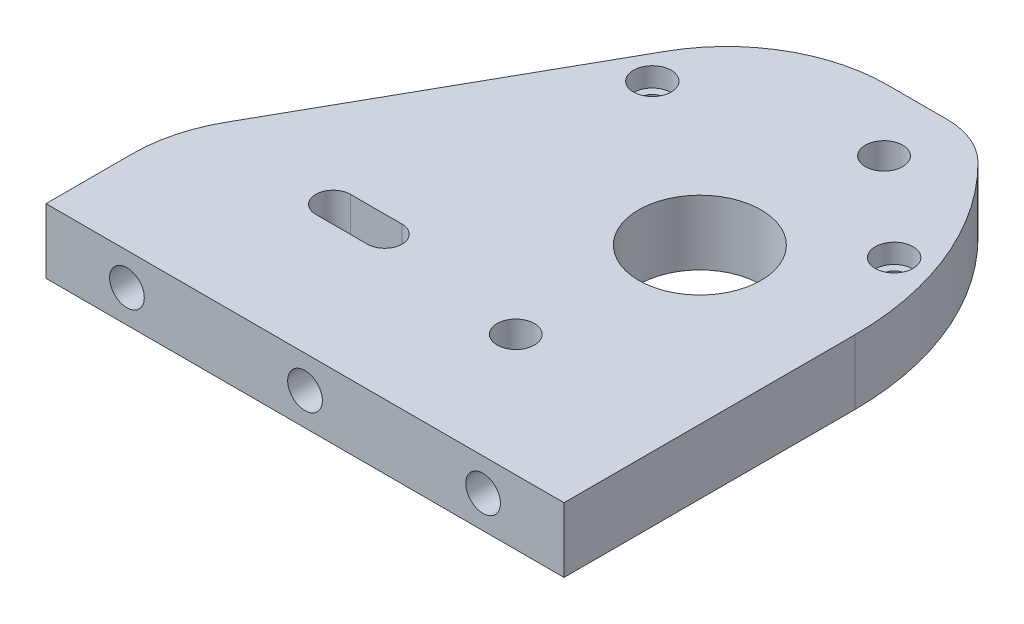
ISO-10303-21;
HEADER;
FILE_DESCRIPTION(('STEP AP214'),'2;1');
FILE_NAME('part.step','',(''),(''),'','','');
FILE_SCHEMA(('AUTOMOTIVE_DESIGN { 1 0 10303 214 1 1 1 1 }'));
ENDSEC;
DATA;
#1=APPLICATION_CONTEXT('core data for automotive mechanical design processes');
#2=APPLICATION_PROTOCOL_DEFINITION('international standard','automotive_design',2000,#1);
#3=PRODUCT_CONTEXT('',#1,'mechanical');
#4=PRODUCT('Part','Part','',(#3));
#5=PRODUCT_RELATED_PRODUCT_CATEGORY('part','',(#4));
#6=PRODUCT_DEFINITION_FORMATION('','',#4);
#7=PRODUCT_DEFINITION_CONTEXT('part definition',#1,'design');
#8=PRODUCT_DEFINITION('design','',#6,#7);
#9=PRODUCT_DEFINITION_SHAPE('','',#8);
#10=(LENGTH_UNIT() NAMED_UNIT(*) SI_UNIT(.MILLI.,.METRE.));
#11=(NAMED_UNIT(*) PLANE_ANGLE_UNIT() SI_UNIT($,.RADIAN.));
#12=(NAMED_UNIT(*) SI_UNIT($,.STERADIAN.) SOLID_ANGLE_UNIT());
#13=UNCERTAINTY_MEASURE_WITH_UNIT(LENGTH_MEASURE(1.E-05),#10,'distance_accuracy_value','');
#14=(GEOMETRIC_REPRESENTATION_CONTEXT(3) GLOBAL_UNCERTAINTY_ASSIGNED_CONTEXT((#13)) GLOBAL_UNIT_ASSIGNED_CONTEXT((#10,
#11,#12)) REPRESENTATION_CONTEXT('',''));
#15=CARTESIAN_POINT('',(0.,0.,0.));
#16=DIRECTION('',(0.,0.,1.));
#17=DIRECTION('',(1.,0.,0.));
#18=AXIS2_PLACEMENT_3D('',#15,#16,#17);
#19=CARTESIAN_POINT('',(0.,-9.525,0.));
#20=DIRECTION('',(0.,1.,0.));
#21=DIRECTION('',(0.,0.,-1.));
#22=AXIS2_PLACEMENT_3D('',#19,#20,#21);
#23=PLANE('',#22);
#24=DIRECTION('',(1.,0.,0.));
#25=VECTOR('',#24,1.);
#26=CARTESIAN_POINT('',(18.030825,-9.525,-23.5800563674416));
#27=LINE('',#26,#25);
#28=CARTESIAN_POINT('',(18.030825,-9.525,-23.5800563674416));
#29=VERTEX_POINT('',#28);
#30=CARTESIAN_POINT('',(25.625425,-9.525,-23.5800563674416));
#31=VERTEX_POINT('',#30);
#32=EDGE_CURVE('E222',#29,#31,#27,.T.);
#33=ORIENTED_EDGE('',*,*,#32,.F.);
#34=CARTESIAN_POINT('',(18.030825,-9.525,-21.0273563674416));
#35=DIRECTION('',(0.,1.,0.));
#36=DIRECTION('',(0.,0.,1.));
#37=AXIS2_PLACEMENT_3D('',#34,#35,#36);
#38=CIRCLE('',#37,2.5527);
#39=CARTESIAN_POINT('',(18.030825,-9.525,-18.4746563674416));
#40=VERTEX_POINT('',#39);
#41=EDGE_CURVE('E224',#29,#40,#38,.T.);
#42=ORIENTED_EDGE('',*,*,#41,.T.);
#43=DIRECTION('',(1.,0.,0.));
#44=VECTOR('',#43,1.);
#45=CARTESIAN_POINT('',(18.030825,-9.525,-18.4746563674416));
#46=LINE('',#45,#44);
#47=CARTESIAN_POINT('',(25.625425,-9.525,-18.4746563674416));
#48=VERTEX_POINT('',#47);
#49=EDGE_CURVE('E215',#40,#48,#46,.T.);
#50=ORIENTED_EDGE('',*,*,#49,.T.);
#51=CARTESIAN_POINT('',(25.625425,-9.525,-21.0273563674416));
#52=DIRECTION('',(0.,1.,0.));
#53=DIRECTION('',(0.,0.,1.));
#54=AXIS2_PLACEMENT_3D('',#51,#52,#53);
#55=CIRCLE('',#54,2.5527);
#56=EDGE_CURVE('E230',#48,#31,#55,.T.);
#57=ORIENTED_EDGE('',*,*,#56,.T.);
#58=EDGE_LOOP('',(#33,#42,#50,#57));
#59=FACE_BOUND('',#58,.T.);
#60=CARTESIAN_POINT('',(25.8140218113133,-9.525,-60.2002575391825));
#61=DIRECTION('',(0.,-1.,0.));
#62=DIRECTION('',(0.,0.,-1.));
#63=AXIS2_PLACEMENT_3D('',#60,#61,#62);
#64=CIRCLE('',#63,1.63195);
#65=CARTESIAN_POINT('',(25.8140218113133,-9.525,-61.8322075391825));
#66=VERTEX_POINT('',#65);
#67=EDGE_CURVE('E246',#66,#66,#64,.T.);
#68=ORIENTED_EDGE('',*,*,#67,.F.);
#69=EDGE_LOOP('',(#68));
#70=FACE_BOUND('',#69,.T.);
#71=CARTESIAN_POINT('',(66.0757685720033,-9.525,-55.5088169021917));
#72=DIRECTION('',(0.,-1.,0.));
#73=DIRECTION('',(0.,0.,-1.));
#74=AXIS2_PLACEMENT_3D('',#71,#72,#73);
#75=CIRCLE('',#74,1.63194999999999);
#76=CARTESIAN_POINT('',(66.0757685720033,-9.525,-57.1407669021917));
#77=VERTEX_POINT('',#76);
#78=EDGE_CURVE('E258',#77,#77,#75,.T.);
#79=ORIENTED_EDGE('',*,*,#78,.F.);
#80=EDGE_LOOP('',(#79));
#81=FACE_BOUND('',#80,.T.);
#82=CARTESIAN_POINT('',(52.3796621440065,-9.525,-67.7136843923407));
#83=DIRECTION('',(0.,1.,0.));
#84=DIRECTION('',(0.,0.,1.));
#85=AXIS2_PLACEMENT_3D('',#82,#83,#84);
#86=CIRCLE('',#85,6.11999999999999);
#87=CARTESIAN_POINT('',(52.3796621440065,-9.525,-61.5936843923407));
#88=VERTEX_POINT('',#87);
#89=EDGE_CURVE('E261',#88,#88,#86,.T.);
#90=ORIENTED_EDGE('',*,*,#89,.T.);
#91=EDGE_LOOP('',(#90));
#92=FACE_BOUND('',#91,.T.);
#93=CARTESIAN_POINT('',(48.021875,-9.525,-17.9039494120426));
#94=DIRECTION('',(0.,1.,0.));
#95=DIRECTION('',(0.,0.,1.));
#96=AXIS2_PLACEMENT_3D('',#93,#94,#95);
#97=CIRCLE('',#96,6.11999999999999);
#98=CARTESIAN_POINT('',(48.021875,-9.525,-11.7839494120426));
#99=VERTEX_POINT('',#98);
#100=EDGE_CURVE('E273',#99,#99,#97,.T.);
#101=ORIENTED_EDGE('',*,*,#100,.T.);
#102=EDGE_LOOP('',(#101));
#103=FACE_BOUND('',#102,.T.);
#104=CARTESIAN_POINT('',(50.2007685720033,-9.525,-42.8088169021917));
#105=DIRECTION('',(0.,1.,0.));
#106=DIRECTION('',(0.,0.,1.));
#107=AXIS2_PLACEMENT_3D('',#104,#105,#106);
#108=CIRCLE('',#107,8.99999999999999);
#109=CARTESIAN_POINT('',(50.2007685720033,-9.525,-33.8088169021917));
#110=VERTEX_POINT('',#109);
#111=EDGE_CURVE('E285',#110,#110,#108,.T.);
#112=ORIENTED_EDGE('',*,*,#111,.T.);
#113=EDGE_LOOP('',(#112));
#114=FACE_BOUND('',#113,.T.);
#115=DIRECTION('',(0.,0.,1.));
#116=VECTOR('',#115,1.);
#117=CARTESIAN_POINT('',(73.025,-9.52500000000001,-101.6));
#118=LINE('',#117,#116);
#119=CARTESIAN_POINT('',(73.025,-9.52500000000001,-42.7680148106246));
#120=VERTEX_POINT('',#119);
#121=CARTESIAN_POINT('',(73.025,-9.52500000000001,0.));
#122=VERTEX_POINT('',#121);
#123=EDGE_CURVE('E213',#120,#122,#118,.T.);
#124=ORIENTED_EDGE('',*,*,#123,.T.);
#125=DIRECTION('',(1.,0.,0.));
#126=VECTOR('',#125,1.);
#127=CARTESIAN_POINT('',(0.,-9.525,0.));
#128=LINE('',#127,#126);
#129=CARTESIAN_POINT('',(-3.17499999999998,-9.52500000000001,0.));
#130=VERTEX_POINT('',#129);
#131=EDGE_CURVE('E310',#130,#122,#128,.T.);
#132=ORIENTED_EDGE('',*,*,#131,.F.);
#133=DIRECTION('',(0.,0.,-1.));
#134=VECTOR('',#133,1.);
#135=CARTESIAN_POINT('',(-3.175,-9.52500000000001,-101.6));
#136=LINE('',#135,#134);
#137=CARTESIAN_POINT('',(-3.17499999999998,-9.52500000000001,-12.7));
#138=VERTEX_POINT('',#137);
#139=EDGE_CURVE('E205',#130,#138,#136,.T.);
#140=ORIENTED_EDGE('',*,*,#139,.T.);
#141=CARTESIAN_POINT('',(19.0002047376904,-9.52500000000001,-12.7));
#142=DIRECTION('',(0.,1.,0.));
#143=DIRECTION('',(0.,0.,1.));
#144=AXIS2_PLACEMENT_3D('',#141,#142,#143);
#145=CIRCLE('',#144,22.1752047376904);
#146=CARTESIAN_POINT('',(-0.322426516871673,-9.52500000000001,-23.5800563674416));
#147=VERTEX_POINT('',#146);
#148=EDGE_CURVE('E178',#147,#138,#145,.T.);
#149=ORIENTED_EDGE('',*,*,#148,.F.);
#150=DIRECTION('',(-0.490640627500011,0.,0.871362022724422));
#151=VECTOR('',#150,1.);
#152=CARTESIAN_POINT('',(-10.3258873267677,-9.52500000000001,-5.8142307162519));
#153=LINE('',#152,#151);
#154=CARTESIAN_POINT('',(22.9795865303334,-9.52500000000001,-64.9636843923407));
#155=VERTEX_POINT('',#154);
#156=EDGE_CURVE('E180',#155,#147,#153,.T.);
#157=ORIENTED_EDGE('',*,*,#156,.F.);
#158=CARTESIAN_POINT('',(43.5849903578951,-9.52500000000001,-53.3613331305353));
#159=DIRECTION('',(0.,1.,0.));
#160=DIRECTION('',(0.,0.,1.));
#161=AXIS2_PLACEMENT_3D('',#158,#159,#160);
#162=CIRCLE('',#161,23.6473512618054);
#163=CARTESIAN_POINT('',(43.5849903578951,-9.52500000000001,-77.0086843923407));
#164=VERTEX_POINT('',#163);
#165=EDGE_CURVE('E170',#164,#155,#162,.T.);
#166=ORIENTED_EDGE('',*,*,#165,.F.);
#167=DIRECTION('',(-1.,0.,0.));
#168=VECTOR('',#167,1.);
#169=CARTESIAN_POINT('',(1.21517915318178E-13,-9.52500000000001,-77.0086843923408));
#170=LINE('',#169,#168);
#171=CARTESIAN_POINT('',(52.3796621440065,-9.52500000000001,-77.0086843923407));
#172=VERTEX_POINT('',#171);
#173=EDGE_CURVE('E149',#172,#164,#170,.T.);
#174=ORIENTED_EDGE('',*,*,#173,.F.);
#175=CARTESIAN_POINT('',(52.3796621440065,-9.52500000000001,-66.0667424082866));
#176=DIRECTION('',(0.,1.,0.));
#177=DIRECTION('',(0.,0.,1.));
#178=AXIS2_PLACEMENT_3D('',#175,#176,#177);
#179=CIRCLE('',#178,10.9419419840542);
#180=CARTESIAN_POINT('',(60.0868475316006,-9.52500000000001,-73.8336843923407));
#181=VERTEX_POINT('',#180);
#182=EDGE_CURVE('E160',#172,#181,#179,.F.);
#183=ORIENTED_EDGE('',*,*,#182,.T.);
#184=CARTESIAN_POINT('',(29.2601881915944,-9.52500000000001,-42.7680148106246));
#185=DIRECTION('',(0.,1.,0.));
#186=DIRECTION('',(0.,0.,1.));
#187=AXIS2_PLACEMENT_3D('',#184,#185,#186);
#188=CIRCLE('',#187,43.7648118084056);
#189=EDGE_CURVE('E165',#120,#181,#188,.T.);
#190=ORIENTED_EDGE('',*,*,#189,.F.);
#191=EDGE_LOOP('',(#124,#132,#140,#149,#157,#166,#174,#183,#190));
#192=FACE_BOUND('',#191,.T.);
#193=ADVANCED_FACE('F39',(#59,#70,#81,#92,#103,#114,#192),#23,.F.);
#194=CARTESIAN_POINT('',(0.,0.,0.));
#195=DIRECTION('',(0.,1.,0.));
#196=DIRECTION('',(0.,0.,-1.));
#197=AXIS2_PLACEMENT_3D('',#194,#195,#196);
#198=PLANE('',#197);
#199=CARTESIAN_POINT('',(50.2007685720033,0.,-42.8088169021917));
#200=DIRECTION('',(0.,1.,0.));
#201=DIRECTION('',(0.,0.,1.));
#202=AXIS2_PLACEMENT_3D('',#199,#200,#201);
#203=CIRCLE('',#202,9.);
#204=CARTESIAN_POINT('',(50.2007685720033,0.,-33.8088169021917));
#205=VERTEX_POINT('',#204);
#206=EDGE_CURVE('E288',#205,#205,#203,.T.);
#207=ORIENTED_EDGE('',*,*,#206,.F.);
#208=EDGE_LOOP('',(#207));
#209=FACE_BOUND('',#208,.T.);
#210=CARTESIAN_POINT('',(48.021875,0.,-17.9039494120426));
#211=DIRECTION('',(0.,1.,0.));
#212=DIRECTION('',(0.,0.,1.));
#213=AXIS2_PLACEMENT_3D('',#210,#211,#212);
#214=CIRCLE('',#213,2.75);
#215=CARTESIAN_POINT('',(48.021875,0.,-15.1539494120426));
#216=VERTEX_POINT('',#215);
#217=EDGE_CURVE('E282',#216,#216,#214,.T.);
#218=ORIENTED_EDGE('',*,*,#217,.F.);
#219=EDGE_LOOP('',(#218));
#220=FACE_BOUND('',#219,.T.);
#221=CARTESIAN_POINT('',(52.3796621440065,0.,-67.7136843923407));
#222=DIRECTION('',(0.,1.,0.));
#223=DIRECTION('',(0.,0.,1.));
#224=AXIS2_PLACEMENT_3D('',#221,#222,#223);
#225=CIRCLE('',#224,2.75);
#226=CARTESIAN_POINT('',(52.3796621440065,0.,-64.9636843923407));
#227=VERTEX_POINT('',#226);
#228=EDGE_CURVE('E270',#227,#227,#225,.T.);
#229=ORIENTED_EDGE('',*,*,#228,.F.);
#230=EDGE_LOOP('',(#229));
#231=FACE_BOUND('',#230,.T.);
#232=CARTESIAN_POINT('',(66.0757685720033,0.,-55.5088169021917));
#233=DIRECTION('',(0.,-1.,0.));
#234=DIRECTION('',(0.,0.,-1.));
#235=AXIS2_PLACEMENT_3D('',#232,#233,#234);
#236=CIRCLE('',#235,2.77876000000001);
#237=CARTESIAN_POINT('',(66.0757685720033,0.,-58.2875769021917));
#238=VERTEX_POINT('',#237);
#239=EDGE_CURVE('E249',#238,#238,#236,.T.);
#240=ORIENTED_EDGE('',*,*,#239,.T.);
#241=EDGE_LOOP('',(#240));
#242=FACE_BOUND('',#241,.T.);
#243=CARTESIAN_POINT('',(25.8140218113133,0.,-60.2002575391825));
#244=DIRECTION('',(0.,-1.,0.));
#245=DIRECTION('',(0.,0.,-1.));
#246=AXIS2_PLACEMENT_3D('',#243,#244,#245);
#247=CIRCLE('',#246,2.77876);
#248=CARTESIAN_POINT('',(25.8140218113133,0.,-62.9790175391825));
#249=VERTEX_POINT('',#248);
#250=EDGE_CURVE('E237',#249,#249,#247,.T.);
#251=ORIENTED_EDGE('',*,*,#250,.T.);
#252=EDGE_LOOP('',(#251));
#253=FACE_BOUND('',#252,.T.);
#254=DIRECTION('',(-1.,0.,0.));
#255=VECTOR('',#254,1.);
#256=CARTESIAN_POINT('',(0.,0.,-18.4746563674416));
#257=LINE('',#256,#255);
#258=CARTESIAN_POINT('',(25.625425,0.,-18.4746563674416));
#259=VERTEX_POINT('',#258);
#260=CARTESIAN_POINT('',(18.030825,0.,-18.4746563674416));
#261=VERTEX_POINT('',#260);
#262=EDGE_CURVE('E11',#259,#261,#257,.T.);
#263=ORIENTED_EDGE('',*,*,#262,.T.);
#264=CARTESIAN_POINT('',(18.030825,0.,-21.0273563674416));
#265=DIRECTION('',(0.,-1.,0.));
#266=DIRECTION('',(0.,0.,-1.));
#267=AXIS2_PLACEMENT_3D('',#264,#265,#266);
#268=CIRCLE('',#267,2.5527);
#269=CARTESIAN_POINT('',(18.030825,0.,-23.5800563674416));
#270=VERTEX_POINT('',#269);
#271=EDGE_CURVE('E47',#261,#270,#268,.T.);
#272=ORIENTED_EDGE('',*,*,#271,.T.);
#273=DIRECTION('',(1.,0.,0.));
#274=VECTOR('',#273,1.);
#275=CARTESIAN_POINT('',(0.,0.,-23.5800563674416));
#276=LINE('',#275,#274);
#277=CARTESIAN_POINT('',(25.625425,0.,-23.5800563674416));
#278=VERTEX_POINT('',#277);
#279=EDGE_CURVE('E313',#270,#278,#276,.T.);
#280=ORIENTED_EDGE('',*,*,#279,.T.);
#281=CARTESIAN_POINT('',(25.625425,0.,-21.0273563674416));
#282=DIRECTION('',(0.,-1.,0.));
#283=DIRECTION('',(0.,0.,-1.));
#284=AXIS2_PLACEMENT_3D('',#281,#282,#283);
#285=CIRCLE('',#284,2.5527);
#286=EDGE_CURVE('E318',#278,#259,#285,.T.);
#287=ORIENTED_EDGE('',*,*,#286,.T.);
#288=EDGE_LOOP('',(#263,#272,#280,#287));
#289=FACE_BOUND('',#288,.T.);
#290=CARTESIAN_POINT('',(29.2601881915944,0.,-42.7680148106246));
#291=DIRECTION('',(0.,1.,0.));
#292=DIRECTION('',(0.,0.,1.));
#293=AXIS2_PLACEMENT_3D('',#290,#291,#292);
#294=CIRCLE('',#293,43.7648118084056);
#295=CARTESIAN_POINT('',(73.025,0.,-42.7680148106246));
#296=VERTEX_POINT('',#295);
#297=CARTESIAN_POINT('',(60.0868475316006,0.,-73.8336843923407));
#298=VERTEX_POINT('',#297);
#299=EDGE_CURVE('E188',#296,#298,#294,.T.);
#300=ORIENTED_EDGE('',*,*,#299,.T.);
#301=CARTESIAN_POINT('',(52.3796621440065,0.,-66.0667424082866));
#302=DIRECTION('',(0.,1.,0.));
#303=DIRECTION('',(0.,0.,1.));
#304=AXIS2_PLACEMENT_3D('',#301,#302,#303);
#305=CIRCLE('',#304,10.9419419840542);
#306=CARTESIAN_POINT('',(52.3796621440065,0.,-77.0086843923407));
#307=VERTEX_POINT('',#306);
#308=EDGE_CURVE('E186',#307,#298,#305,.F.);
#309=ORIENTED_EDGE('',*,*,#308,.F.);
#310=DIRECTION('',(-1.,0.,0.));
#311=VECTOR('',#310,1.);
#312=CARTESIAN_POINT('',(1.21517915318178E-13,0.,-77.0086843923408));
#313=LINE('',#312,#311);
#314=CARTESIAN_POINT('',(43.5849903578951,0.,-77.0086843923407));
#315=VERTEX_POINT('',#314);
#316=EDGE_CURVE('E152',#307,#315,#313,.T.);
#317=ORIENTED_EDGE('',*,*,#316,.T.);
#318=CARTESIAN_POINT('',(43.5849903578951,0.,-53.3613331305353));
#319=DIRECTION('',(0.,1.,0.));
#320=DIRECTION('',(0.,0.,1.));
#321=AXIS2_PLACEMENT_3D('',#318,#319,#320);
#322=CIRCLE('',#321,23.6473512618054);
#323=CARTESIAN_POINT('',(22.9795865303334,0.,-64.9636843923407));
#324=VERTEX_POINT('',#323);
#325=EDGE_CURVE('E171',#315,#324,#322,.T.);
#326=ORIENTED_EDGE('',*,*,#325,.T.);
#327=DIRECTION('',(-0.490640627500011,0.,0.871362022724422));
#328=VECTOR('',#327,1.);
#329=CARTESIAN_POINT('',(-10.3258873267677,0.,-5.8142307162519));
#330=LINE('',#329,#328);
#331=CARTESIAN_POINT('',(-0.322426516871673,0.,-23.5800563674416));
#332=VERTEX_POINT('',#331);
#333=EDGE_CURVE('E174',#324,#332,#330,.T.);
#334=ORIENTED_EDGE('',*,*,#333,.T.);
#335=CARTESIAN_POINT('',(19.0002047376904,0.,-12.7));
#336=DIRECTION('',(0.,1.,0.));
#337=DIRECTION('',(0.,0.,1.));
#338=AXIS2_PLACEMENT_3D('',#335,#336,#337);
#339=CIRCLE('',#338,22.1752047376904);
#340=CARTESIAN_POINT('',(-3.17499999999999,0.,-12.7));
#341=VERTEX_POINT('',#340);
#342=EDGE_CURVE('E191',#332,#341,#339,.T.);
#343=ORIENTED_EDGE('',*,*,#342,.T.);
#344=DIRECTION('',(0.,0.,1.));
#345=VECTOR('',#344,1.);
#346=CARTESIAN_POINT('',(-3.175,0.,-101.6));
#347=LINE('',#346,#345);
#348=CARTESIAN_POINT('',(-3.17499999999998,0.,0.));
#349=VERTEX_POINT('',#348);
#350=EDGE_CURVE('E156',#341,#349,#347,.T.);
#351=ORIENTED_EDGE('',*,*,#350,.T.);
#352=DIRECTION('',(1.,0.,0.));
#353=VECTOR('',#352,1.);
#354=CARTESIAN_POINT('',(0.,0.,0.));
#355=LINE('',#354,#353);
#356=CARTESIAN_POINT('',(73.025,0.,0.));
#357=VERTEX_POINT('',#356);
#358=EDGE_CURVE('E309',#349,#357,#355,.T.);
#359=ORIENTED_EDGE('',*,*,#358,.T.);
#360=DIRECTION('',(0.,0.,-1.));
#361=VECTOR('',#360,1.);
#362=CARTESIAN_POINT('',(73.025,0.,-101.6));
#363=LINE('',#362,#361);
#364=EDGE_CURVE('E208',#357,#296,#363,.T.);
#365=ORIENTED_EDGE('',*,*,#364,.T.);
#366=EDGE_LOOP('',(#300,#309,#317,#326,#334,#343,#351,#359,#365));
#367=FACE_BOUND('',#366,.T.);
#368=ADVANCED_FACE('F323',(#209,#220,#231,#242,#253,#289,#367),#198,.T.);
#369=CARTESIAN_POINT('',(-3.175,-111.174597269246,-101.6));
#370=DIRECTION('',(1.,0.,0.));
#371=DIRECTION('',(0.,0.,-1.));
#372=AXIS2_PLACEMENT_3D('',#369,#370,#371);
#373=PLANE('',#372);
#374=DIRECTION('',(0.,1.,0.));
#375=VECTOR('',#374,1.);
#376=CARTESIAN_POINT('',(-3.17499999999998,-9.52500000000001,-12.7));
#377=LINE('',#376,#375);
#378=EDGE_CURVE('E54',#138,#341,#377,.T.);
#379=ORIENTED_EDGE('',*,*,#378,.F.);
#380=ORIENTED_EDGE('',*,*,#139,.F.);
#381=DIRECTION('',(0.,1.,0.));
#382=VECTOR('',#381,1.);
#383=CARTESIAN_POINT('',(-3.17499999999998,-111.174597269246,0.));
#384=LINE('',#383,#382);
#385=EDGE_CURVE('E209',#130,#349,#384,.T.);
#386=ORIENTED_EDGE('',*,*,#385,.T.);
#387=ORIENTED_EDGE('',*,*,#350,.F.);
#388=EDGE_LOOP('',(#379,#380,#386,#387));
#389=FACE_BOUND('',#388,.T.);
#390=ADVANCED_FACE('F388',(#389),#373,.F.);
#391=CARTESIAN_POINT('',(0.,-9.525,0.));
#392=DIRECTION('',(0.,0.,-1.));
#393=DIRECTION('',(-1.,0.,0.));
#394=AXIS2_PLACEMENT_3D('',#391,#392,#393);
#395=PLANE('',#394);
#396=CARTESIAN_POINT('',(8.73125,-4.7625,0.));
#397=DIRECTION('',(0.,0.,-1.));
#398=DIRECTION('',(1.,0.,0.));
#399=AXIS2_PLACEMENT_3D('',#396,#397,#398);
#400=CIRCLE('',#399,2.5527);
#401=CARTESIAN_POINT('',(11.28395,-4.7625,0.));
#402=VERTEX_POINT('',#401);
#403=EDGE_CURVE('E291',#402,#402,#400,.T.);
#404=ORIENTED_EDGE('',*,*,#403,.T.);
#405=EDGE_LOOP('',(#404));
#406=FACE_BOUND('',#405,.T.);
#407=CARTESIAN_POINT('',(61.11875,-4.7625,0.));
#408=DIRECTION('',(0.,0.,-1.));
#409=DIRECTION('',(1.,0.,0.));
#410=AXIS2_PLACEMENT_3D('',#407,#408,#409);
#411=CIRCLE('',#410,2.55269999999999);
#412=CARTESIAN_POINT('',(63.67145,-4.7625,0.));
#413=VERTEX_POINT('',#412);
#414=EDGE_CURVE('E297',#413,#413,#411,.T.);
#415=ORIENTED_EDGE('',*,*,#414,.T.);
#416=EDGE_LOOP('',(#415));
#417=FACE_BOUND('',#416,.T.);
#418=CARTESIAN_POINT('',(34.925,-4.7625,0.));
#419=DIRECTION('',(0.,0.,-1.));
#420=DIRECTION('',(1.,0.,0.));
#421=AXIS2_PLACEMENT_3D('',#418,#419,#420);
#422=CIRCLE('',#421,2.5527);
#423=CARTESIAN_POINT('',(37.4777,-4.7625,0.));
#424=VERTEX_POINT('',#423);
#425=EDGE_CURVE('E303',#424,#424,#422,.T.);
#426=ORIENTED_EDGE('',*,*,#425,.T.);
#427=EDGE_LOOP('',(#426));
#428=FACE_BOUND('',#427,.T.);
#429=ORIENTED_EDGE('',*,*,#358,.F.);
#430=ORIENTED_EDGE('',*,*,#385,.F.);
#431=ORIENTED_EDGE('',*,*,#131,.T.);
#432=DIRECTION('',(0.,1.,0.));
#433=VECTOR('',#432,1.);
#434=CARTESIAN_POINT('',(73.025,-111.174597269246,0.));
#435=LINE('',#434,#433);
#436=EDGE_CURVE('E216',#122,#357,#435,.T.);
#437=ORIENTED_EDGE('',*,*,#436,.T.);
#438=EDGE_LOOP('',(#429,#430,#431,#437));
#439=FACE_BOUND('',#438,.T.);
#440=ADVANCED_FACE('F41',(#406,#417,#428,#439),#395,.F.);
#441=CARTESIAN_POINT('',(34.925,-4.7625,-19.05));
#442=DIRECTION('',(0.,0.,1.));
#443=DIRECTION('',(1.,0.,0.));
#444=AXIS2_PLACEMENT_3D('',#441,#442,#443);
#445=CONICAL_SURFACE('',#444,2.5527,1.02974425867665);
#446=CARTESIAN_POINT('',(34.925,-4.7625,-20.5838169021917));
#447=VERTEX_POINT('',#446);
#448=VERTEX_LOOP('',#447);
#449=FACE_BOUND('',#448,.T.);
#450=CARTESIAN_POINT('',(34.925,-4.7625,-19.05));
#451=DIRECTION('',(0.,0.,-1.));
#452=DIRECTION('',(1.,0.,0.));
#453=AXIS2_PLACEMENT_3D('',#450,#451,#452);
#454=CIRCLE('',#453,2.5527);
#455=CARTESIAN_POINT('',(37.4777,-4.7625,-19.05));
#456=VERTEX_POINT('',#455);
#457=EDGE_CURVE('E306',#456,#456,#454,.T.);
#458=ORIENTED_EDGE('',*,*,#457,.F.);
#459=EDGE_LOOP('',(#458));
#460=FACE_BOUND('',#459,.T.);
#461=ADVANCED_FACE('F383',(#449,#460),#445,.F.);
#462=CARTESIAN_POINT('',(34.925,-4.7625,0.));
#463=DIRECTION('',(0.,0.,1.));
#464=DIRECTION('',(1.,0.,0.));
#465=AXIS2_PLACEMENT_3D('',#462,#463,#464);
#466=CYLINDRICAL_SURFACE('',#465,2.5527);
#467=ORIENTED_EDGE('',*,*,#457,.T.);
#468=EDGE_LOOP('',(#467));
#469=FACE_BOUND('',#468,.T.);
#470=ORIENTED_EDGE('',*,*,#425,.F.);
#471=EDGE_LOOP('',(#470));
#472=FACE_BOUND('',#471,.T.);
#473=ADVANCED_FACE('F379',(#469,#472),#466,.F.);
#474=CARTESIAN_POINT('',(61.11875,-4.7625,-19.05));
#475=DIRECTION('',(0.,0.,1.));
#476=DIRECTION('',(1.,0.,0.));
#477=AXIS2_PLACEMENT_3D('',#474,#475,#476);
#478=CONICAL_SURFACE('',#477,2.55269999999999,1.02974425867665);
#479=CARTESIAN_POINT('',(61.11875,-4.7625,-20.5838169021917));
#480=VERTEX_POINT('',#479);
#481=VERTEX_LOOP('',#480);
#482=FACE_BOUND('',#481,.T.);
#483=CARTESIAN_POINT('',(61.11875,-4.7625,-19.05));
#484=DIRECTION('',(0.,0.,-1.));
#485=DIRECTION('',(1.,0.,0.));
#486=AXIS2_PLACEMENT_3D('',#483,#484,#485);
#487=CIRCLE('',#486,2.55269999999999);
#488=CARTESIAN_POINT('',(63.67145,-4.7625,-19.05));
#489=VERTEX_POINT('',#488);
#490=EDGE_CURVE('E300',#489,#489,#487,.T.);
#491=ORIENTED_EDGE('',*,*,#490,.F.);
#492=EDGE_LOOP('',(#491));
#493=FACE_BOUND('',#492,.T.);
#494=ADVANCED_FACE('F375',(#482,#493),#478,.F.);
#495=CARTESIAN_POINT('',(61.11875,-4.7625,0.));
#496=DIRECTION('',(0.,0.,1.));
#497=DIRECTION('',(1.,0.,0.));
#498=AXIS2_PLACEMENT_3D('',#495,#496,#497);
#499=CYLINDRICAL_SURFACE('',#498,2.55269999999999);
#500=ORIENTED_EDGE('',*,*,#490,.T.);
#501=EDGE_LOOP('',(#500));
#502=FACE_BOUND('',#501,.T.);
#503=ORIENTED_EDGE('',*,*,#414,.F.);
#504=EDGE_LOOP('',(#503));
#505=FACE_BOUND('',#504,.T.);
#506=ADVANCED_FACE('F371',(#502,#505),#499,.F.);
#507=CARTESIAN_POINT('',(8.73125,-4.7625,-19.05));
#508=DIRECTION('',(0.,0.,1.));
#509=DIRECTION('',(1.,0.,0.));
#510=AXIS2_PLACEMENT_3D('',#507,#508,#509);
#511=CONICAL_SURFACE('',#510,2.5527,1.02974425867665);
#512=CARTESIAN_POINT('',(8.73124999999999,-4.7625,-20.5838169021917));
#513=VERTEX_POINT('',#512);
#514=VERTEX_LOOP('',#513);
#515=FACE_BOUND('',#514,.T.);
#516=CARTESIAN_POINT('',(8.73125,-4.7625,-19.05));
#517=DIRECTION('',(0.,0.,-1.));
#518=DIRECTION('',(1.,0.,0.));
#519=AXIS2_PLACEMENT_3D('',#516,#517,#518);
#520=CIRCLE('',#519,2.5527);
#521=CARTESIAN_POINT('',(11.28395,-4.7625,-19.05));
#522=VERTEX_POINT('',#521);
#523=EDGE_CURVE('E294',#522,#522,#520,.T.);
#524=ORIENTED_EDGE('',*,*,#523,.F.);
#525=EDGE_LOOP('',(#524));
#526=FACE_BOUND('',#525,.T.);
#527=ADVANCED_FACE('F364',(#515,#526),#511,.F.);
#528=CARTESIAN_POINT('',(8.73125,-4.7625,0.));
#529=DIRECTION('',(0.,0.,1.));
#530=DIRECTION('',(1.,0.,0.));
#531=AXIS2_PLACEMENT_3D('',#528,#529,#530);
#532=CYLINDRICAL_SURFACE('',#531,2.5527);
#533=ORIENTED_EDGE('',*,*,#523,.T.);
#534=EDGE_LOOP('',(#533));
#535=FACE_BOUND('',#534,.T.);
#536=ORIENTED_EDGE('',*,*,#403,.F.);
#537=EDGE_LOOP('',(#536));
#538=FACE_BOUND('',#537,.T.);
#539=ADVANCED_FACE('F354',(#535,#538),#532,.F.);
#540=CARTESIAN_POINT('',(50.2007685720033,-9.525,-42.8088169021917));
#541=DIRECTION('',(0.,-1.,0.));
#542=DIRECTION('',(0.,0.,1.));
#543=AXIS2_PLACEMENT_3D('',#540,#541,#542);
#544=CYLINDRICAL_SURFACE('',#543,8.99999999999999);
#545=ORIENTED_EDGE('',*,*,#206,.T.);
#546=EDGE_LOOP('',(#545));
#547=FACE_BOUND('',#546,.T.);
#548=ORIENTED_EDGE('',*,*,#111,.F.);
#549=EDGE_LOOP('',(#548));
#550=FACE_BOUND('',#549,.T.);
#551=ADVANCED_FACE('F351',(#547,#550),#544,.F.);
#552=CARTESIAN_POINT('',(48.021875,-9.525,-17.9039494120426));
#553=DIRECTION('',(0.,-1.,0.));
#554=DIRECTION('',(0.,0.,1.));
#555=AXIS2_PLACEMENT_3D('',#552,#553,#554);
#556=CYLINDRICAL_SURFACE('',#555,2.75);
#557=ORIENTED_EDGE('',*,*,#217,.T.);
#558=EDGE_LOOP('',(#557));
#559=FACE_BOUND('',#558,.T.);
#560=CARTESIAN_POINT('',(48.021875,-5.945,-17.9039494120426));
#561=DIRECTION('',(0.,1.,0.));
#562=DIRECTION('',(0.,0.,1.));
#563=AXIS2_PLACEMENT_3D('',#560,#561,#562);
#564=CIRCLE('',#563,2.75);
#565=CARTESIAN_POINT('',(48.021875,-5.945,-15.1539494120426));
#566=VERTEX_POINT('',#565);
#567=EDGE_CURVE('E279',#566,#566,#564,.T.);
#568=ORIENTED_EDGE('',*,*,#567,.F.);
#569=EDGE_LOOP('',(#568));
#570=FACE_BOUND('',#569,.T.);
#571=ADVANCED_FACE('F353',(#559,#570),#556,.F.);
#572=CARTESIAN_POINT('',(50.771875,-5.945,-17.9039494120426));
#573=DIRECTION('',(0.,1.,0.));
#574=DIRECTION('',(0.,0.,-1.));
#575=AXIS2_PLACEMENT_3D('',#572,#573,#574);
#576=PLANE('',#575);
#577=ORIENTED_EDGE('',*,*,#567,.T.);
#578=EDGE_LOOP('',(#577));
#579=FACE_BOUND('',#578,.T.);
#580=CARTESIAN_POINT('',(48.021875,-5.945,-17.9039494120426));
#581=DIRECTION('',(0.,1.,0.));
#582=DIRECTION('',(0.,0.,1.));
#583=AXIS2_PLACEMENT_3D('',#580,#581,#582);
#584=CIRCLE('',#583,6.12000000000001);
#585=CARTESIAN_POINT('',(48.021875,-5.945,-11.7839494120426));
#586=VERTEX_POINT('',#585);
#587=EDGE_CURVE('E276',#586,#586,#584,.T.);
#588=ORIENTED_EDGE('',*,*,#587,.F.);
#589=EDGE_LOOP('',(#588));
#590=FACE_BOUND('',#589,.T.);
#591=ADVANCED_FACE('F361',(#579,#590),#576,.F.);
#592=CARTESIAN_POINT('',(48.021875,-9.525,-17.9039494120426));
#593=DIRECTION('',(0.,-1.,0.));
#594=DIRECTION('',(0.,0.,1.));
#595=AXIS2_PLACEMENT_3D('',#592,#593,#594);
#596=CYLINDRICAL_SURFACE('',#595,6.12);
#597=ORIENTED_EDGE('',*,*,#587,.T.);
#598=EDGE_LOOP('',(#597));
#599=FACE_BOUND('',#598,.T.);
#600=ORIENTED_EDGE('',*,*,#100,.F.);
#601=EDGE_LOOP('',(#600));
#602=FACE_BOUND('',#601,.T.);
#603=ADVANCED_FACE('F446',(#599,#602),#596,.F.);
#604=CARTESIAN_POINT('',(52.3796621440065,-9.525,-67.7136843923407));
#605=DIRECTION('',(0.,-1.,0.));
#606=DIRECTION('',(0.,0.,1.));
#607=AXIS2_PLACEMENT_3D('',#604,#605,#606);
#608=CYLINDRICAL_SURFACE('',#607,2.75);
#609=ORIENTED_EDGE('',*,*,#228,.T.);
#610=EDGE_LOOP('',(#609));
#611=FACE_BOUND('',#610,.T.);
#612=CARTESIAN_POINT('',(52.3796621440065,-5.945,-67.7136843923407));
#613=DIRECTION('',(0.,1.,0.));
#614=DIRECTION('',(0.,0.,1.));
#615=AXIS2_PLACEMENT_3D('',#612,#613,#614);
#616=CIRCLE('',#615,2.75);
#617=CARTESIAN_POINT('',(52.3796621440065,-5.945,-64.9636843923407));
#618=VERTEX_POINT('',#617);
#619=EDGE_CURVE('E267',#618,#618,#616,.T.);
#620=ORIENTED_EDGE('',*,*,#619,.F.);
#621=EDGE_LOOP('',(#620));
#622=FACE_BOUND('',#621,.T.);
#623=ADVANCED_FACE('F442',(#611,#622),#608,.F.);
#624=CARTESIAN_POINT('',(55.1296621440065,-5.945,-67.7136843923407));
#625=DIRECTION('',(0.,1.,0.));
#626=DIRECTION('',(0.,0.,-1.));
#627=AXIS2_PLACEMENT_3D('',#624,#625,#626);
#628=PLANE('',#627);
#629=ORIENTED_EDGE('',*,*,#619,.T.);
#630=EDGE_LOOP('',(#629));
#631=FACE_BOUND('',#630,.T.);
#632=CARTESIAN_POINT('',(52.3796621440065,-5.945,-67.7136843923407));
#633=DIRECTION('',(0.,1.,0.));
#634=DIRECTION('',(0.,0.,1.));
#635=AXIS2_PLACEMENT_3D('',#632,#633,#634);
#636=CIRCLE('',#635,6.12000000000001);
#637=CARTESIAN_POINT('',(52.3796621440065,-5.945,-61.5936843923407));
#638=VERTEX_POINT('',#637);
#639=EDGE_CURVE('E264',#638,#638,#636,.T.);
#640=ORIENTED_EDGE('',*,*,#639,.F.);
#641=EDGE_LOOP('',(#640));
#642=FACE_BOUND('',#641,.T.);
#643=ADVANCED_FACE('F438',(#631,#642),#628,.F.);
#644=CARTESIAN_POINT('',(52.3796621440065,-9.525,-67.7136843923407));
#645=DIRECTION('',(0.,-1.,0.));
#646=DIRECTION('',(0.,0.,1.));
#647=AXIS2_PLACEMENT_3D('',#644,#645,#646);
#648=CYLINDRICAL_SURFACE('',#647,6.12);
#649=ORIENTED_EDGE('',*,*,#639,.T.);
#650=EDGE_LOOP('',(#649));
#651=FACE_BOUND('',#650,.T.);
#652=ORIENTED_EDGE('',*,*,#89,.F.);
#653=EDGE_LOOP('',(#652));
#654=FACE_BOUND('',#653,.T.);
#655=ADVANCED_FACE('F434',(#651,#654),#648,.F.);
#656=CARTESIAN_POINT('',(66.0757685720033,0.,-55.5088169021917));
#657=DIRECTION('',(0.,1.,0.));
#658=DIRECTION('',(0.,0.,-1.));
#659=AXIS2_PLACEMENT_3D('',#656,#657,#658);
#660=CYLINDRICAL_SURFACE('',#659,1.63195);
#661=ORIENTED_EDGE('',*,*,#78,.T.);
#662=EDGE_LOOP('',(#661));
#663=FACE_BOUND('',#662,.T.);
#664=CARTESIAN_POINT('',(66.0757685720033,-2.8448,-55.5088169021917));
#665=DIRECTION('',(0.,-1.,0.));
#666=DIRECTION('',(0.,0.,-1.));
#667=AXIS2_PLACEMENT_3D('',#664,#665,#666);
#668=CIRCLE('',#667,1.63195000000001);
#669=CARTESIAN_POINT('',(66.0757685720033,-2.8448,-57.1407669021917));
#670=VERTEX_POINT('',#669);
#671=EDGE_CURVE('E255',#670,#670,#668,.T.);
#672=ORIENTED_EDGE('',*,*,#671,.F.);
#673=EDGE_LOOP('',(#672));
#674=FACE_BOUND('',#673,.T.);
#675=ADVANCED_FACE('F430',(#663,#674),#660,.F.);
#676=CARTESIAN_POINT('',(67.7077185720033,-2.8448,-55.5088169021917));
#677=DIRECTION('',(0.,-1.,0.));
#678=DIRECTION('',(0.,0.,1.));
#679=AXIS2_PLACEMENT_3D('',#676,#677,#678);
#680=PLANE('',#679);
#681=ORIENTED_EDGE('',*,*,#671,.T.);
#682=EDGE_LOOP('',(#681));
#683=FACE_BOUND('',#682,.T.);
#684=CARTESIAN_POINT('',(66.0757685720033,-2.8448,-55.5088169021917));
#685=DIRECTION('',(0.,-1.,0.));
#686=DIRECTION('',(0.,0.,-1.));
#687=AXIS2_PLACEMENT_3D('',#684,#685,#686);
#688=CIRCLE('',#687,2.77876000000001);
#689=CARTESIAN_POINT('',(66.0757685720033,-2.8448,-58.2875769021917));
#690=VERTEX_POINT('',#689);
#691=EDGE_CURVE('E252',#690,#690,#688,.T.);
#692=ORIENTED_EDGE('',*,*,#691,.F.);
#693=EDGE_LOOP('',(#692));
#694=FACE_BOUND('',#693,.T.);
#695=ADVANCED_FACE('F426',(#683,#694),#680,.F.);
#696=CARTESIAN_POINT('',(66.0757685720033,0.,-55.5088169021917));
#697=DIRECTION('',(0.,1.,0.));
#698=DIRECTION('',(0.,0.,-1.));
#699=AXIS2_PLACEMENT_3D('',#696,#697,#698);
#700=CYLINDRICAL_SURFACE('',#699,2.77876000000001);
#701=ORIENTED_EDGE('',*,*,#691,.T.);
#702=EDGE_LOOP('',(#701));
#703=FACE_BOUND('',#702,.T.);
#704=ORIENTED_EDGE('',*,*,#239,.F.);
#705=EDGE_LOOP('',(#704));
#706=FACE_BOUND('',#705,.T.);
#707=ADVANCED_FACE('F422',(#703,#706),#700,.F.);
#708=CARTESIAN_POINT('',(25.8140218113133,0.,-60.2002575391825));
#709=DIRECTION('',(0.,1.,0.));
#710=DIRECTION('',(0.,0.,-1.));
#711=AXIS2_PLACEMENT_3D('',#708,#709,#710);
#712=CYLINDRICAL_SURFACE('',#711,1.63195);
#713=ORIENTED_EDGE('',*,*,#67,.T.);
#714=EDGE_LOOP('',(#713));
#715=FACE_BOUND('',#714,.T.);
#716=CARTESIAN_POINT('',(25.8140218113133,-2.8448,-60.2002575391825));
#717=DIRECTION('',(0.,-1.,0.));
#718=DIRECTION('',(0.,0.,-1.));
#719=AXIS2_PLACEMENT_3D('',#716,#717,#718);
#720=CIRCLE('',#719,1.63195);
#721=CARTESIAN_POINT('',(25.8140218113133,-2.8448,-61.8322075391825));
#722=VERTEX_POINT('',#721);
#723=EDGE_CURVE('E243',#722,#722,#720,.T.);
#724=ORIENTED_EDGE('',*,*,#723,.F.);
#725=EDGE_LOOP('',(#724));
#726=FACE_BOUND('',#725,.T.);
#727=ADVANCED_FACE('F415',(#715,#726),#712,.F.);
#728=CARTESIAN_POINT('',(27.4459718113133,-2.8448,-60.2002575391825));
#729=DIRECTION('',(0.,-1.,0.));
#730=DIRECTION('',(0.,0.,1.));
#731=AXIS2_PLACEMENT_3D('',#728,#729,#730);
#732=PLANE('',#731);
#733=ORIENTED_EDGE('',*,*,#723,.T.);
#734=EDGE_LOOP('',(#733));
#735=FACE_BOUND('',#734,.T.);
#736=CARTESIAN_POINT('',(25.8140218113133,-2.8448,-60.2002575391825));
#737=DIRECTION('',(0.,-1.,0.));
#738=DIRECTION('',(0.,0.,-1.));
#739=AXIS2_PLACEMENT_3D('',#736,#737,#738);
#740=CIRCLE('',#739,2.77876);
#741=CARTESIAN_POINT('',(25.8140218113133,-2.8448,-62.9790175391825));
#742=VERTEX_POINT('',#741);
#743=EDGE_CURVE('E240',#742,#742,#740,.T.);
#744=ORIENTED_EDGE('',*,*,#743,.F.);
#745=EDGE_LOOP('',(#744));
#746=FACE_BOUND('',#745,.T.);
#747=ADVANCED_FACE('F407',(#735,#746),#732,.F.);
#748=CARTESIAN_POINT('',(25.8140218113133,0.,-60.2002575391825));
#749=DIRECTION('',(0.,1.,0.));
#750=DIRECTION('',(0.,0.,-1.));
#751=AXIS2_PLACEMENT_3D('',#748,#749,#750);
#752=CYLINDRICAL_SURFACE('',#751,2.77876);
#753=ORIENTED_EDGE('',*,*,#743,.T.);
#754=EDGE_LOOP('',(#753));
#755=FACE_BOUND('',#754,.T.);
#756=ORIENTED_EDGE('',*,*,#250,.F.);
#757=EDGE_LOOP('',(#756));
#758=FACE_BOUND('',#757,.T.);
#759=ADVANCED_FACE('F405',(#755,#758),#752,.F.);
#760=CARTESIAN_POINT('',(25.625425,-9.525,-21.0273563674416));
#761=DIRECTION('',(0.,-1.,0.));
#762=DIRECTION('',(0.,0.,1.));
#763=AXIS2_PLACEMENT_3D('',#760,#761,#762);
#764=CYLINDRICAL_SURFACE('',#763,2.5527);
#765=ORIENTED_EDGE('',*,*,#286,.F.);
#766=DIRECTION('',(0.,-1.,0.));
#767=VECTOR('',#766,1.);
#768=CARTESIAN_POINT('',(25.625425,-9.525,-23.5800563674416));
#769=LINE('',#768,#767);
#770=EDGE_CURVE('E233',#278,#31,#769,.T.);
#771=ORIENTED_EDGE('',*,*,#770,.T.);
#772=ORIENTED_EDGE('',*,*,#56,.F.);
#773=DIRECTION('',(0.,-1.,0.));
#774=VECTOR('',#773,1.);
#775=CARTESIAN_POINT('',(25.625425,-9.525,-18.4746563674416));
#776=LINE('',#775,#774);
#777=EDGE_CURVE('E235',#48,#259,#776,.F.);
#778=ORIENTED_EDGE('',*,*,#777,.T.);
#779=EDGE_LOOP('',(#765,#771,#772,#778));
#780=FACE_BOUND('',#779,.T.);
#781=ADVANCED_FACE('F334',(#780),#764,.F.);
#782=CARTESIAN_POINT('',(18.030825,-9.525,-21.0273563674416));
#783=DIRECTION('',(0.,-1.,0.));
#784=DIRECTION('',(0.,0.,1.));
#785=AXIS2_PLACEMENT_3D('',#782,#783,#784);
#786=CYLINDRICAL_SURFACE('',#785,2.5527);
#787=ORIENTED_EDGE('',*,*,#271,.F.);
#788=DIRECTION('',(0.,-1.,0.));
#789=VECTOR('',#788,1.);
#790=CARTESIAN_POINT('',(18.030825,-9.525,-18.4746563674416));
#791=LINE('',#790,#789);
#792=EDGE_CURVE('E227',#261,#40,#791,.T.);
#793=ORIENTED_EDGE('',*,*,#792,.T.);
#794=ORIENTED_EDGE('',*,*,#41,.F.);
#795=DIRECTION('',(0.,-1.,0.));
#796=VECTOR('',#795,1.);
#797=CARTESIAN_POINT('',(18.030825,-9.525,-23.5800563674416));
#798=LINE('',#797,#796);
#799=EDGE_CURVE('E62',#29,#270,#798,.F.);
#800=ORIENTED_EDGE('',*,*,#799,.T.);
#801=EDGE_LOOP('',(#787,#793,#794,#800));
#802=FACE_BOUND('',#801,.T.);
#803=ADVANCED_FACE('F327',(#802),#786,.F.);
#804=CARTESIAN_POINT('',(18.030825,-9.525,-23.5800563674416));
#805=DIRECTION('',(0.,0.,-1.));
#806=DIRECTION('',(-1.,0.,0.));
#807=AXIS2_PLACEMENT_3D('',#804,#805,#806);
#808=PLANE('',#807);
#809=ORIENTED_EDGE('',*,*,#279,.F.);
#810=ORIENTED_EDGE('',*,*,#799,.F.);
#811=ORIENTED_EDGE('',*,*,#32,.T.);
#812=ORIENTED_EDGE('',*,*,#770,.F.);
#813=EDGE_LOOP('',(#809,#810,#811,#812));
#814=FACE_BOUND('',#813,.T.);
#815=ADVANCED_FACE('F330',(#814),#808,.F.);
#816=CARTESIAN_POINT('',(18.030825,-9.525,-18.4746563674416));
#817=DIRECTION('',(0.,0.,1.));
#818=DIRECTION('',(1.,0.,0.));
#819=AXIS2_PLACEMENT_3D('',#816,#817,#818);
#820=PLANE('',#819);
#821=ORIENTED_EDGE('',*,*,#262,.F.);
#822=ORIENTED_EDGE('',*,*,#777,.F.);
#823=ORIENTED_EDGE('',*,*,#49,.F.);
#824=ORIENTED_EDGE('',*,*,#792,.F.);
#825=EDGE_LOOP('',(#821,#822,#823,#824));
#826=FACE_BOUND('',#825,.T.);
#827=ADVANCED_FACE('F336',(#826),#820,.F.);
#828=CARTESIAN_POINT('',(73.025,-111.174597269246,-101.6));
#829=DIRECTION('',(-1.,0.,0.));
#830=DIRECTION('',(0.,0.,1.));
#831=AXIS2_PLACEMENT_3D('',#828,#829,#830);
#832=PLANE('',#831);
#833=ORIENTED_EDGE('',*,*,#364,.F.);
#834=ORIENTED_EDGE('',*,*,#436,.F.);
#835=ORIENTED_EDGE('',*,*,#123,.F.);
#836=DIRECTION('',(0.,1.,0.));
#837=VECTOR('',#836,1.);
#838=CARTESIAN_POINT('',(73.025,-9.52500000000001,-42.7680148106246));
#839=LINE('',#838,#837);
#840=EDGE_CURVE('E202',#120,#296,#839,.T.);
#841=ORIENTED_EDGE('',*,*,#840,.T.);
#842=EDGE_LOOP('',(#833,#834,#835,#841));
#843=FACE_BOUND('',#842,.T.);
#844=ADVANCED_FACE('F531',(#843),#832,.F.);
#845=CARTESIAN_POINT('',(1.21517915318178E-13,-9.52500000000001,-77.0086843923408));
#846=DIRECTION('',(0.,0.,1.));
#847=DIRECTION('',(1.,0.,0.));
#848=AXIS2_PLACEMENT_3D('',#845,#846,#847);
#849=PLANE('',#848);
#850=ORIENTED_EDGE('',*,*,#316,.F.);
#851=DIRECTION('',(0.,1.,0.));
#852=VECTOR('',#851,1.);
#853=CARTESIAN_POINT('',(52.3796621440065,-9.52500000000001,-77.0086843923407));
#854=LINE('',#853,#852);
#855=EDGE_CURVE('E145',#172,#307,#854,.T.);
#856=ORIENTED_EDGE('',*,*,#855,.F.);
#857=ORIENTED_EDGE('',*,*,#173,.T.);
#858=DIRECTION('',(0.,1.,0.));
#859=VECTOR('',#858,1.);
#860=CARTESIAN_POINT('',(43.5849903578951,-9.52500000000001,-77.0086843923407));
#861=LINE('',#860,#859);
#862=EDGE_CURVE('E184',#164,#315,#861,.T.);
#863=ORIENTED_EDGE('',*,*,#862,.T.);
#864=EDGE_LOOP('',(#850,#856,#857,#863));
#865=FACE_BOUND('',#864,.T.);
#866=ADVANCED_FACE('F147',(#865),#849,.F.);
#867=CARTESIAN_POINT('',(52.3796621440065,-9.52500000000001,-66.0667424082866));
#868=DIRECTION('',(0.,1.,0.));
#869=DIRECTION('',(0.,0.,-1.));
#870=AXIS2_PLACEMENT_3D('',#867,#868,#869);
#871=CYLINDRICAL_SURFACE('',#870,10.9419419840542);
#872=ORIENTED_EDGE('',*,*,#308,.T.);
#873=DIRECTION('',(0.,1.,0.));
#874=VECTOR('',#873,1.);
#875=CARTESIAN_POINT('',(60.0868475316006,-9.52500000000001,-73.8336843923407));
#876=LINE('',#875,#874);
#877=EDGE_CURVE('E157',#181,#298,#876,.T.);
#878=ORIENTED_EDGE('',*,*,#877,.F.);
#879=ORIENTED_EDGE('',*,*,#182,.F.);
#880=ORIENTED_EDGE('',*,*,#855,.T.);
#881=EDGE_LOOP('',(#872,#878,#879,#880));
#882=FACE_BOUND('',#881,.T.);
#883=ADVANCED_FACE('F161',(#882),#871,.T.);
#884=CARTESIAN_POINT('',(29.2601881915944,-9.52500000000001,-42.7680148106246));
#885=DIRECTION('',(0.,1.,0.));
#886=DIRECTION('',(0.,0.,-1.));
#887=AXIS2_PLACEMENT_3D('',#884,#885,#886);
#888=CYLINDRICAL_SURFACE('',#887,43.7648118084056);
#889=ORIENTED_EDGE('',*,*,#299,.F.);
#890=ORIENTED_EDGE('',*,*,#840,.F.);
#891=ORIENTED_EDGE('',*,*,#189,.T.);
#892=ORIENTED_EDGE('',*,*,#877,.T.);
#893=EDGE_LOOP('',(#889,#890,#891,#892));
#894=FACE_BOUND('',#893,.T.);
#895=ADVANCED_FACE('F557',(#894),#888,.T.);
#896=CARTESIAN_POINT('',(19.0002047376904,-9.52500000000001,-12.7));
#897=DIRECTION('',(0.,1.,0.));
#898=DIRECTION('',(0.,0.,-1.));
#899=AXIS2_PLACEMENT_3D('',#896,#897,#898);
#900=CYLINDRICAL_SURFACE('',#899,22.1752047376904);
#901=ORIENTED_EDGE('',*,*,#342,.F.);
#902=DIRECTION('',(0.,1.,0.));
#903=VECTOR('',#902,1.);
#904=CARTESIAN_POINT('',(-0.322426516871673,-9.52500000000001,-23.5800563674416));
#905=LINE('',#904,#903);
#906=EDGE_CURVE('E199',#147,#332,#905,.T.);
#907=ORIENTED_EDGE('',*,*,#906,.F.);
#908=ORIENTED_EDGE('',*,*,#148,.T.);
#909=ORIENTED_EDGE('',*,*,#378,.T.);
#910=EDGE_LOOP('',(#901,#907,#908,#909));
#911=FACE_BOUND('',#910,.T.);
#912=ADVANCED_FACE('F566',(#911),#900,.T.);
#913=CARTESIAN_POINT('',(-10.3258873267677,-9.52500000000001,-5.8142307162519));
#914=DIRECTION('',(0.871362022724422,0.,0.490640627500011));
#915=DIRECTION('',(0.490640627500011,0.,-0.871362022724422));
#916=AXIS2_PLACEMENT_3D('',#913,#914,#915);
#917=PLANE('',#916);
#918=ORIENTED_EDGE('',*,*,#333,.F.);
#919=DIRECTION('',(0.,1.,0.));
#920=VECTOR('',#919,1.);
#921=CARTESIAN_POINT('',(22.9795865303334,-9.52500000000001,-64.9636843923407));
#922=LINE('',#921,#920);
#923=EDGE_CURVE('E197',#155,#324,#922,.T.);
#924=ORIENTED_EDGE('',*,*,#923,.F.);
#925=ORIENTED_EDGE('',*,*,#156,.T.);
#926=ORIENTED_EDGE('',*,*,#906,.T.);
#927=EDGE_LOOP('',(#918,#924,#925,#926));
#928=FACE_BOUND('',#927,.T.);
#929=ADVANCED_FACE('F576',(#928),#917,.F.);
#930=CARTESIAN_POINT('',(43.5849903578951,-9.52500000000001,-53.3613331305353));
#931=DIRECTION('',(0.,1.,0.));
#932=DIRECTION('',(0.,0.,-1.));
#933=AXIS2_PLACEMENT_3D('',#930,#931,#932);
#934=CYLINDRICAL_SURFACE('',#933,23.6473512618054);
#935=ORIENTED_EDGE('',*,*,#325,.F.);
#936=ORIENTED_EDGE('',*,*,#862,.F.);
#937=ORIENTED_EDGE('',*,*,#165,.T.);
#938=ORIENTED_EDGE('',*,*,#923,.T.);
#939=EDGE_LOOP('',(#935,#936,#937,#938));
#940=FACE_BOUND('',#939,.T.);
#941=ADVANCED_FACE('F585',(#940),#934,.T.);
#942=CLOSED_SHELL('',(#193,#368,#390,#440,#461,#473,#494,#506,#527,#539,#551,#571,#591,#603,
#623,#643,#655,#675,#695,#707,#727,#747,#759,#781,#803,#815,#827,#844,#866,#883,#895,#912,#929,#941));
#943=MANIFOLD_SOLID_BREP('B2',#942);
#944=ADVANCED_BREP_SHAPE_REPRESENTATION('',(#18,#943),#14);
#945=SHAPE_DEFINITION_REPRESENTATION(#9,#944);
ENDSEC;
END-ISO-10303-21;
